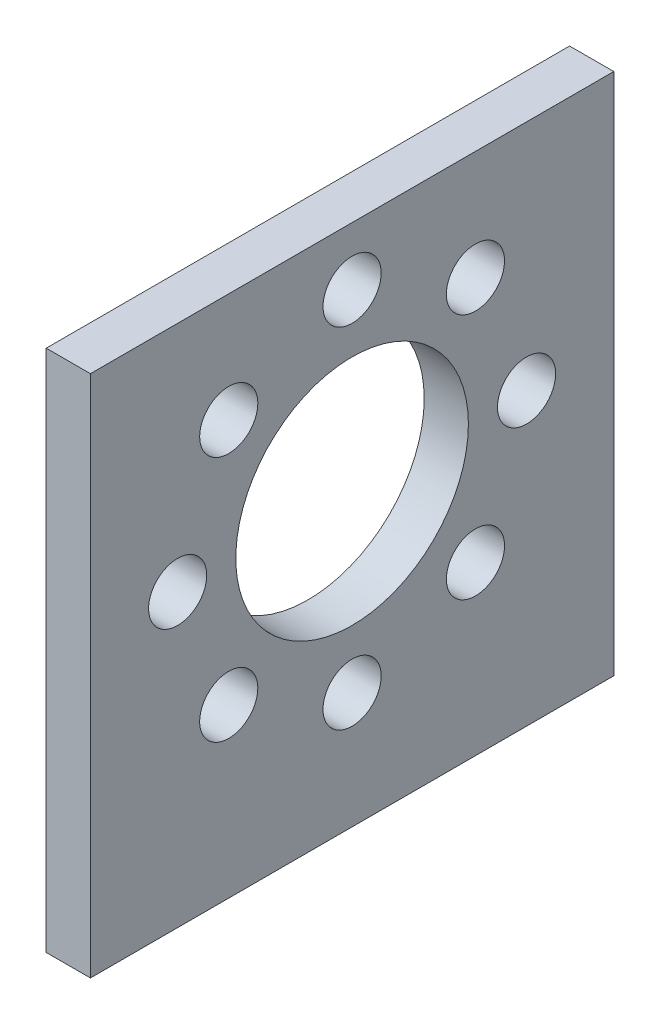
ISO-10303-21;
HEADER;
FILE_DESCRIPTION(('STEP AP214'),'2;1');
FILE_NAME('part.step','',(''),(''),'','','');
FILE_SCHEMA(('AUTOMOTIVE_DESIGN { 1 0 10303 214 1 1 1 1 }'));
ENDSEC;
DATA;
#1=APPLICATION_CONTEXT('core data for automotive mechanical design processes');
#2=APPLICATION_PROTOCOL_DEFINITION('international standard','automotive_design',2000,#1);
#3=PRODUCT_CONTEXT('',#1,'mechanical');
#4=PRODUCT('Part','Part','',(#3));
#5=PRODUCT_RELATED_PRODUCT_CATEGORY('part','',(#4));
#6=PRODUCT_DEFINITION_FORMATION('','',#4);
#7=PRODUCT_DEFINITION_CONTEXT('part definition',#1,'design');
#8=PRODUCT_DEFINITION('design','',#6,#7);
#9=PRODUCT_DEFINITION_SHAPE('','',#8);
#10=(LENGTH_UNIT() NAMED_UNIT(*) SI_UNIT(.MILLI.,.METRE.));
#11=(NAMED_UNIT(*) PLANE_ANGLE_UNIT() SI_UNIT($,.RADIAN.));
#12=(NAMED_UNIT(*) SI_UNIT($,.STERADIAN.) SOLID_ANGLE_UNIT());
#13=UNCERTAINTY_MEASURE_WITH_UNIT(LENGTH_MEASURE(1.E-05),#10,'distance_accuracy_value','');
#14=(GEOMETRIC_REPRESENTATION_CONTEXT(3) GLOBAL_UNCERTAINTY_ASSIGNED_CONTEXT((#13)) GLOBAL_UNIT_ASSIGNED_CONTEXT((#10,
#11,#12)) REPRESENTATION_CONTEXT('',''));
#15=CARTESIAN_POINT('',(0.,0.,0.));
#16=DIRECTION('',(0.,0.,1.));
#17=DIRECTION('',(1.,0.,0.));
#18=AXIS2_PLACEMENT_3D('',#15,#16,#17);
#19=CARTESIAN_POINT('',(4.826,0.,-9.13813740933418));
#20=DIRECTION('',(0.,0.,1.));
#21=DIRECTION('',(0.,-1.,0.));
#22=AXIS2_PLACEMENT_3D('',#19,#20,#21);
#23=PLANE('',#22);
#24=DIRECTION('',(0.,1.,0.));
#25=VECTOR('',#24,1.);
#26=CARTESIAN_POINT('',(0.,0.,-9.13813740933418));
#27=LINE('',#26,#25);
#28=CARTESIAN_POINT('',(0.,-21.6650709307293,-9.13813740933419));
#29=VERTEX_POINT('',#28);
#30=CARTESIAN_POINT('',(0.,35.4849290692707,-9.13813740933418));
#31=VERTEX_POINT('',#30);
#32=EDGE_CURVE('E108',#29,#31,#27,.T.);
#33=ORIENTED_EDGE('',*,*,#32,.T.);
#34=DIRECTION('',(-1.,0.,0.));
#35=VECTOR('',#34,1.);
#36=CARTESIAN_POINT('',(4.826,35.4849290692707,-9.13813740933418));
#37=LINE('',#36,#35);
#38=CARTESIAN_POINT('',(4.826,35.4849290692707,-9.13813740933418));
#39=VERTEX_POINT('',#38);
#40=EDGE_CURVE('E11',#39,#31,#37,.T.);
#41=ORIENTED_EDGE('',*,*,#40,.F.);
#42=DIRECTION('',(0.,1.,0.));
#43=VECTOR('',#42,1.);
#44=CARTESIAN_POINT('',(4.826,0.,-9.13813740933418));
#45=LINE('',#44,#43);
#46=CARTESIAN_POINT('',(4.826,-21.6650709307293,-9.13813740933419));
#47=VERTEX_POINT('',#46);
#48=EDGE_CURVE('E93',#47,#39,#45,.T.);
#49=ORIENTED_EDGE('',*,*,#48,.F.);
#50=DIRECTION('',(-1.,0.,0.));
#51=VECTOR('',#50,1.);
#52=CARTESIAN_POINT('',(4.826,-21.6650709307293,-9.13813740933419));
#53=LINE('',#52,#51);
#54=EDGE_CURVE('E107',#47,#29,#53,.T.);
#55=ORIENTED_EDGE('',*,*,#54,.T.);
#56=EDGE_LOOP('',(#33,#41,#49,#55));
#57=FACE_BOUND('',#56,.T.);
#58=ADVANCED_FACE('F41',(#57),#23,.F.);
#59=CARTESIAN_POINT('',(4.826,35.4849290692707,0.));
#60=DIRECTION('',(0.,-1.,0.));
#61=DIRECTION('',(0.,0.,-1.));
#62=AXIS2_PLACEMENT_3D('',#59,#60,#61);
#63=PLANE('',#62);
#64=DIRECTION('',(0.,0.,1.));
#65=VECTOR('',#64,1.);
#66=CARTESIAN_POINT('',(0.,35.4849290692707,0.));
#67=LINE('',#66,#65);
#68=CARTESIAN_POINT('',(0.,35.4849290692707,48.0118625906658));
#69=VERTEX_POINT('',#68);
#70=EDGE_CURVE('E97',#31,#69,#67,.T.);
#71=ORIENTED_EDGE('',*,*,#70,.T.);
#72=DIRECTION('',(-1.,0.,0.));
#73=VECTOR('',#72,1.);
#74=CARTESIAN_POINT('',(4.826,35.4849290692707,48.0118625906658));
#75=LINE('',#74,#73);
#76=CARTESIAN_POINT('',(4.826,35.4849290692707,48.0118625906658));
#77=VERTEX_POINT('',#76);
#78=EDGE_CURVE('E49',#77,#69,#75,.T.);
#79=ORIENTED_EDGE('',*,*,#78,.F.);
#80=DIRECTION('',(0.,0.,1.));
#81=VECTOR('',#80,1.);
#82=CARTESIAN_POINT('',(4.826,35.4849290692707,0.));
#83=LINE('',#82,#81);
#84=EDGE_CURVE('E87',#39,#77,#83,.T.);
#85=ORIENTED_EDGE('',*,*,#84,.F.);
#86=ORIENTED_EDGE('',*,*,#40,.T.);
#87=EDGE_LOOP('',(#71,#79,#85,#86));
#88=FACE_BOUND('',#87,.T.);
#89=ADVANCED_FACE('F96',(#88),#63,.F.);
#90=CARTESIAN_POINT('',(4.826,0.,48.0118625906658));
#91=DIRECTION('',(0.,0.,-1.));
#92=DIRECTION('',(-1.,0.,0.));
#93=AXIS2_PLACEMENT_3D('',#90,#91,#92);
#94=PLANE('',#93);
#95=DIRECTION('',(0.,-1.,0.));
#96=VECTOR('',#95,1.);
#97=CARTESIAN_POINT('',(0.,0.,48.0118625906658));
#98=LINE('',#97,#96);
#99=CARTESIAN_POINT('',(0.,-21.6650709307293,48.0118625906658));
#100=VERTEX_POINT('',#99);
#101=EDGE_CURVE('E74',#69,#100,#98,.T.);
#102=ORIENTED_EDGE('',*,*,#101,.T.);
#103=DIRECTION('',(-1.,0.,0.));
#104=VECTOR('',#103,1.);
#105=CARTESIAN_POINT('',(4.826,-21.6650709307293,48.0118625906658));
#106=LINE('',#105,#104);
#107=CARTESIAN_POINT('',(4.826,-21.6650709307293,48.0118625906658));
#108=VERTEX_POINT('',#107);
#109=EDGE_CURVE('E98',#108,#100,#106,.T.);
#110=ORIENTED_EDGE('',*,*,#109,.F.);
#111=DIRECTION('',(0.,-1.,0.));
#112=VECTOR('',#111,1.);
#113=CARTESIAN_POINT('',(4.826,0.,48.0118625906658));
#114=LINE('',#113,#112);
#115=EDGE_CURVE('E91',#77,#108,#114,.T.);
#116=ORIENTED_EDGE('',*,*,#115,.F.);
#117=ORIENTED_EDGE('',*,*,#78,.T.);
#118=EDGE_LOOP('',(#102,#110,#116,#117));
#119=FACE_BOUND('',#118,.T.);
#120=ADVANCED_FACE('F99',(#119),#94,.F.);
#121=CARTESIAN_POINT('',(4.826,-21.6650709307293,0.));
#122=DIRECTION('',(0.,1.,0.));
#123=DIRECTION('',(0.,0.,1.));
#124=AXIS2_PLACEMENT_3D('',#121,#122,#123);
#125=PLANE('',#124);
#126=DIRECTION('',(0.,0.,-1.));
#127=VECTOR('',#126,1.);
#128=CARTESIAN_POINT('',(0.,-21.6650709307293,0.));
#129=LINE('',#128,#127);
#130=EDGE_CURVE('E80',#100,#29,#129,.T.);
#131=ORIENTED_EDGE('',*,*,#130,.T.);
#132=ORIENTED_EDGE('',*,*,#54,.F.);
#133=DIRECTION('',(0.,0.,-1.));
#134=VECTOR('',#133,1.);
#135=CARTESIAN_POINT('',(4.826,-21.6650709307293,0.));
#136=LINE('',#135,#134);
#137=EDGE_CURVE('E57',#108,#47,#136,.T.);
#138=ORIENTED_EDGE('',*,*,#137,.F.);
#139=ORIENTED_EDGE('',*,*,#109,.T.);
#140=EDGE_LOOP('',(#131,#132,#138,#139));
#141=FACE_BOUND('',#140,.T.);
#142=ADVANCED_FACE('F119',(#141),#125,.F.);
#143=CARTESIAN_POINT('',(4.826,10.0849290692707,19.4368625906658));
#144=DIRECTION('',(-1.,0.,0.));
#145=DIRECTION('',(0.,0.,1.));
#146=AXIS2_PLACEMENT_3D('',#143,#144,#145);
#147=CYLINDRICAL_SURFACE('',#146,12.7);
#148=CARTESIAN_POINT('',(4.826,10.0849290692707,19.4368625906658));
#149=DIRECTION('',(1.,0.,0.));
#150=DIRECTION('',(0.,0.,-1.));
#151=AXIS2_PLACEMENT_3D('',#148,#149,#150);
#152=CIRCLE('',#151,12.7);
#153=CARTESIAN_POINT('',(4.826,10.0849290692707,6.73686259066581));
#154=VERTEX_POINT('',#153);
#155=EDGE_CURVE('E101',#154,#154,#152,.T.);
#156=ORIENTED_EDGE('',*,*,#155,.T.);
#157=EDGE_LOOP('',(#156));
#158=FACE_BOUND('',#157,.T.);
#159=CARTESIAN_POINT('',(0.,10.0849290692707,19.4368625906658));
#160=DIRECTION('',(1.,0.,0.));
#161=DIRECTION('',(0.,0.,-1.));
#162=AXIS2_PLACEMENT_3D('',#159,#160,#161);
#163=CIRCLE('',#162,12.7);
#164=CARTESIAN_POINT('',(0.,10.0849290692707,6.73686259066581));
#165=VERTEX_POINT('',#164);
#166=EDGE_CURVE('E115',#165,#165,#163,.T.);
#167=ORIENTED_EDGE('',*,*,#166,.F.);
#168=EDGE_LOOP('',(#167));
#169=FACE_BOUND('',#168,.T.);
#170=ADVANCED_FACE('F179',(#158,#169),#147,.F.);
#171=CARTESIAN_POINT('',(4.826,0.,0.));
#172=DIRECTION('',(1.,0.,0.));
#173=DIRECTION('',(0.,0.,-1.));
#174=AXIS2_PLACEMENT_3D('',#171,#172,#173);
#175=PLANE('',#174);
#176=CARTESIAN_POINT('',(4.826,10.0849290692706,0.386862590665813));
#177=DIRECTION('',(1.,0.,0.));
#178=DIRECTION('',(0.,-1.,0.));
#179=AXIS2_PLACEMENT_3D('',#176,#177,#178);
#180=CIRCLE('',#179,3.175);
#181=CARTESIAN_POINT('',(4.826,6.90992906927063,0.386862590665824));
#182=VERTEX_POINT('',#181);
#183=EDGE_CURVE('E155',#182,#182,#180,.T.);
#184=ORIENTED_EDGE('',*,*,#183,.F.);
#185=EDGE_LOOP('',(#184));
#186=FACE_BOUND('',#185,.T.);
#187=CARTESIAN_POINT('',(4.826,-3.38545511233311,5.96647840906216));
#188=DIRECTION('',(1.,0.,0.));
#189=DIRECTION('',(0.,-0.707106781186544,0.707106781186551));
#190=AXIS2_PLACEMENT_3D('',#187,#188,#189);
#191=CIRCLE('',#190,3.175);
#192=CARTESIAN_POINT('',(4.826,-5.63051914260039,8.21154243932946));
#193=VERTEX_POINT('',#192);
#194=EDGE_CURVE('E149',#193,#193,#191,.T.);
#195=ORIENTED_EDGE('',*,*,#194,.F.);
#196=EDGE_LOOP('',(#195));
#197=FACE_BOUND('',#196,.T.);
#198=CARTESIAN_POINT('',(4.826,-8.96507093072931,19.4368625906658));
#199=DIRECTION('',(1.,0.,0.));
#200=DIRECTION('',(0.,0.,1.));
#201=AXIS2_PLACEMENT_3D('',#198,#199,#200);
#202=CIRCLE('',#201,3.175);
#203=CARTESIAN_POINT('',(4.826,-8.96507093072931,22.6118625906658));
#204=VERTEX_POINT('',#203);
#205=EDGE_CURVE('E141',#204,#204,#202,.T.);
#206=ORIENTED_EDGE('',*,*,#205,.F.);
#207=EDGE_LOOP('',(#206));
#208=FACE_BOUND('',#207,.T.);
#209=CARTESIAN_POINT('',(4.826,-3.38545511233292,32.9072467722697));
#210=DIRECTION('',(1.,0.,0.));
#211=DIRECTION('',(0.,0.707106781186554,0.707106781186541));
#212=AXIS2_PLACEMENT_3D('',#209,#210,#211);
#213=CIRCLE('',#212,3.175);
#214=CARTESIAN_POINT('',(4.826,-1.14039108206561,35.1523108025369));
#215=VERTEX_POINT('',#214);
#216=EDGE_CURVE('E142',#215,#215,#213,.T.);
#217=ORIENTED_EDGE('',*,*,#216,.F.);
#218=EDGE_LOOP('',(#217));
#219=FACE_BOUND('',#218,.T.);
#220=CARTESIAN_POINT('',(4.826,10.0849290692709,38.4868625906658));
#221=DIRECTION('',(1.,0.,0.));
#222=DIRECTION('',(0.,1.,0.));
#223=AXIS2_PLACEMENT_3D('',#220,#221,#222);
#224=CIRCLE('',#223,3.175);
#225=CARTESIAN_POINT('',(4.826,13.2599290692709,38.4868625906658));
#226=VERTEX_POINT('',#225);
#227=EDGE_CURVE('E165',#226,#226,#224,.T.);
#228=ORIENTED_EDGE('',*,*,#227,.F.);
#229=EDGE_LOOP('',(#228));
#230=FACE_BOUND('',#229,.T.);
#231=CARTESIAN_POINT('',(4.826,23.5553132508746,32.9072467722694));
#232=DIRECTION('',(1.,0.,0.));
#233=DIRECTION('',(0.,0.707106781186539,-0.707106781186556));
#234=AXIS2_PLACEMENT_3D('',#231,#232,#233);
#235=CIRCLE('',#234,3.175);
#236=CARTESIAN_POINT('',(4.826,25.8003772811419,30.6621827420021));
#237=VERTEX_POINT('',#236);
#238=EDGE_CURVE('E166',#237,#237,#235,.T.);
#239=ORIENTED_EDGE('',*,*,#238,.F.);
#240=EDGE_LOOP('',(#239));
#241=FACE_BOUND('',#240,.T.);
#242=CARTESIAN_POINT('',(4.826,23.5553132508744,5.96647840906206));
#243=DIRECTION('',(1.,0.,0.));
#244=DIRECTION('',(0.,-0.707106781186549,-0.707106781186546));
#245=AXIS2_PLACEMENT_3D('',#242,#243,#244);
#246=CIRCLE('',#245,3.175);
#247=CARTESIAN_POINT('',(4.826,21.3102492206071,3.72141437879477));
#248=VERTEX_POINT('',#247);
#249=EDGE_CURVE('E134',#248,#248,#246,.T.);
#250=ORIENTED_EDGE('',*,*,#249,.F.);
#251=EDGE_LOOP('',(#250));
#252=FACE_BOUND('',#251,.T.);
#253=CARTESIAN_POINT('',(4.826,29.1349290692707,19.4368625906658));
#254=DIRECTION('',(1.,0.,0.));
#255=DIRECTION('',(0.,0.,-1.));
#256=AXIS2_PLACEMENT_3D('',#253,#254,#255);
#257=CIRCLE('',#256,3.175);
#258=CARTESIAN_POINT('',(4.826,29.1349290692707,16.2618625906658));
#259=VERTEX_POINT('',#258);
#260=EDGE_CURVE('E111',#259,#259,#257,.T.);
#261=ORIENTED_EDGE('',*,*,#260,.F.);
#262=EDGE_LOOP('',(#261));
#263=FACE_BOUND('',#262,.T.);
#264=ORIENTED_EDGE('',*,*,#48,.T.);
#265=ORIENTED_EDGE('',*,*,#84,.T.);
#266=ORIENTED_EDGE('',*,*,#115,.T.);
#267=ORIENTED_EDGE('',*,*,#137,.T.);
#268=EDGE_LOOP('',(#264,#265,#266,#267));
#269=FACE_BOUND('',#268,.T.);
#270=ORIENTED_EDGE('',*,*,#155,.F.);
#271=EDGE_LOOP('',(#270));
#272=FACE_BOUND('',#271,.T.);
#273=ADVANCED_FACE('F88',(#186,#197,#208,#219,#230,#241,#252,#263,#269,#272),#175,.T.);
#274=CARTESIAN_POINT('',(0.,0.,0.));
#275=DIRECTION('',(1.,0.,0.));
#276=DIRECTION('',(0.,0.,-1.));
#277=AXIS2_PLACEMENT_3D('',#274,#275,#276);
#278=PLANE('',#277);
#279=CARTESIAN_POINT('',(0.,10.0849290692706,0.386862590665813));
#280=DIRECTION('',(1.,0.,0.));
#281=DIRECTION('',(0.,-1.,0.));
#282=AXIS2_PLACEMENT_3D('',#279,#280,#281);
#283=CIRCLE('',#282,3.175);
#284=CARTESIAN_POINT('',(0.,6.90992906927063,0.386862590665824));
#285=VERTEX_POINT('',#284);
#286=EDGE_CURVE('E137',#285,#285,#283,.T.);
#287=ORIENTED_EDGE('',*,*,#286,.T.);
#288=EDGE_LOOP('',(#287));
#289=FACE_BOUND('',#288,.T.);
#290=CARTESIAN_POINT('',(0.,-3.38545511233311,5.96647840906216));
#291=DIRECTION('',(1.,0.,0.));
#292=DIRECTION('',(0.,-0.707106781186544,0.707106781186551));
#293=AXIS2_PLACEMENT_3D('',#290,#291,#292);
#294=CIRCLE('',#293,3.175);
#295=CARTESIAN_POINT('',(0.,-5.63051914260039,8.21154243932946));
#296=VERTEX_POINT('',#295);
#297=EDGE_CURVE('E152',#296,#296,#294,.T.);
#298=ORIENTED_EDGE('',*,*,#297,.T.);
#299=EDGE_LOOP('',(#298));
#300=FACE_BOUND('',#299,.T.);
#301=CARTESIAN_POINT('',(0.,-8.96507093072931,19.4368625906658));
#302=DIRECTION('',(1.,0.,0.));
#303=DIRECTION('',(0.,0.,1.));
#304=AXIS2_PLACEMENT_3D('',#301,#302,#303);
#305=CIRCLE('',#304,3.175);
#306=CARTESIAN_POINT('',(0.,-8.96507093072931,22.6118625906658));
#307=VERTEX_POINT('',#306);
#308=EDGE_CURVE('E146',#307,#307,#305,.T.);
#309=ORIENTED_EDGE('',*,*,#308,.T.);
#310=EDGE_LOOP('',(#309));
#311=FACE_BOUND('',#310,.T.);
#312=CARTESIAN_POINT('',(0.,-3.38545511233292,32.9072467722697));
#313=DIRECTION('',(1.,0.,0.));
#314=DIRECTION('',(0.,0.707106781186554,0.707106781186541));
#315=AXIS2_PLACEMENT_3D('',#312,#313,#314);
#316=CIRCLE('',#315,3.175);
#317=CARTESIAN_POINT('',(0.,-1.14039108206561,35.1523108025369));
#318=VERTEX_POINT('',#317);
#319=EDGE_CURVE('E138',#318,#318,#316,.T.);
#320=ORIENTED_EDGE('',*,*,#319,.T.);
#321=EDGE_LOOP('',(#320));
#322=FACE_BOUND('',#321,.T.);
#323=CARTESIAN_POINT('',(0.,10.0849290692709,38.4868625906658));
#324=DIRECTION('',(1.,0.,0.));
#325=DIRECTION('',(0.,1.,0.));
#326=AXIS2_PLACEMENT_3D('',#323,#324,#325);
#327=CIRCLE('',#326,3.175);
#328=CARTESIAN_POINT('',(0.,13.2599290692709,38.4868625906658));
#329=VERTEX_POINT('',#328);
#330=EDGE_CURVE('E145',#329,#329,#327,.T.);
#331=ORIENTED_EDGE('',*,*,#330,.T.);
#332=EDGE_LOOP('',(#331));
#333=FACE_BOUND('',#332,.T.);
#334=CARTESIAN_POINT('',(0.,23.5553132508746,32.9072467722694));
#335=DIRECTION('',(1.,0.,0.));
#336=DIRECTION('',(0.,0.707106781186539,-0.707106781186556));
#337=AXIS2_PLACEMENT_3D('',#334,#335,#336);
#338=CIRCLE('',#337,3.175);
#339=CARTESIAN_POINT('',(0.,25.8003772811419,30.6621827420021));
#340=VERTEX_POINT('',#339);
#341=EDGE_CURVE('E162',#340,#340,#338,.T.);
#342=ORIENTED_EDGE('',*,*,#341,.T.);
#343=EDGE_LOOP('',(#342));
#344=FACE_BOUND('',#343,.T.);
#345=CARTESIAN_POINT('',(0.,23.5553132508744,5.96647840906206));
#346=DIRECTION('',(1.,0.,0.));
#347=DIRECTION('',(0.,-0.707106781186549,-0.707106781186546));
#348=AXIS2_PLACEMENT_3D('',#345,#346,#347);
#349=CIRCLE('',#348,3.175);
#350=CARTESIAN_POINT('',(0.,21.3102492206071,3.72141437879477));
#351=VERTEX_POINT('',#350);
#352=EDGE_CURVE('E129',#351,#351,#349,.T.);
#353=ORIENTED_EDGE('',*,*,#352,.T.);
#354=EDGE_LOOP('',(#353));
#355=FACE_BOUND('',#354,.T.);
#356=CARTESIAN_POINT('',(0.,29.1349290692707,19.4368625906658));
#357=DIRECTION('',(1.,0.,0.));
#358=DIRECTION('',(0.,0.,-1.));
#359=AXIS2_PLACEMENT_3D('',#356,#357,#358);
#360=CIRCLE('',#359,3.175);
#361=CARTESIAN_POINT('',(0.,29.1349290692707,16.2618625906658));
#362=VERTEX_POINT('',#361);
#363=EDGE_CURVE('E126',#362,#362,#360,.T.);
#364=ORIENTED_EDGE('',*,*,#363,.T.);
#365=EDGE_LOOP('',(#364));
#366=FACE_BOUND('',#365,.T.);
#367=ORIENTED_EDGE('',*,*,#32,.F.);
#368=ORIENTED_EDGE('',*,*,#130,.F.);
#369=ORIENTED_EDGE('',*,*,#101,.F.);
#370=ORIENTED_EDGE('',*,*,#70,.F.);
#371=EDGE_LOOP('',(#367,#368,#369,#370));
#372=FACE_BOUND('',#371,.T.);
#373=ORIENTED_EDGE('',*,*,#166,.T.);
#374=EDGE_LOOP('',(#373));
#375=FACE_BOUND('',#374,.T.);
#376=ADVANCED_FACE('F122',(#289,#300,#311,#322,#333,#344,#355,#366,#372,#375),#278,.F.);
#377=CARTESIAN_POINT('',(4.826,29.1349290692707,19.4368625906658));
#378=DIRECTION('',(-1.,0.,0.));
#379=DIRECTION('',(0.,0.,1.));
#380=AXIS2_PLACEMENT_3D('',#377,#378,#379);
#381=CYLINDRICAL_SURFACE('',#380,3.175);
#382=ORIENTED_EDGE('',*,*,#260,.T.);
#383=EDGE_LOOP('',(#382));
#384=FACE_BOUND('',#383,.T.);
#385=ORIENTED_EDGE('',*,*,#363,.F.);
#386=EDGE_LOOP('',(#385));
#387=FACE_BOUND('',#386,.T.);
#388=ADVANCED_FACE('F188',(#384,#387),#381,.F.);
#389=CARTESIAN_POINT('',(4.826,23.5553132508744,5.96647840906206));
#390=DIRECTION('',(-1.,0.,0.));
#391=DIRECTION('',(0.,0.707106781186549,0.707106781186546));
#392=AXIS2_PLACEMENT_3D('',#389,#390,#391);
#393=CYLINDRICAL_SURFACE('',#392,3.175);
#394=ORIENTED_EDGE('',*,*,#249,.T.);
#395=EDGE_LOOP('',(#394));
#396=FACE_BOUND('',#395,.T.);
#397=ORIENTED_EDGE('',*,*,#352,.F.);
#398=EDGE_LOOP('',(#397));
#399=FACE_BOUND('',#398,.T.);
#400=ADVANCED_FACE('F191',(#396,#399),#393,.F.);
#401=CARTESIAN_POINT('',(4.826,23.5553132508746,32.9072467722694));
#402=DIRECTION('',(-1.,0.,0.));
#403=DIRECTION('',(0.,-0.707106781186539,0.707106781186556));
#404=AXIS2_PLACEMENT_3D('',#401,#402,#403);
#405=CYLINDRICAL_SURFACE('',#404,3.175);
#406=ORIENTED_EDGE('',*,*,#238,.T.);
#407=EDGE_LOOP('',(#406));
#408=FACE_BOUND('',#407,.T.);
#409=ORIENTED_EDGE('',*,*,#341,.F.);
#410=EDGE_LOOP('',(#409));
#411=FACE_BOUND('',#410,.T.);
#412=ADVANCED_FACE('F243',(#408,#411),#405,.F.);
#413=CARTESIAN_POINT('',(4.826,10.0849290692709,38.4868625906658));
#414=DIRECTION('',(-1.,0.,0.));
#415=DIRECTION('',(0.,-1.,0.));
#416=AXIS2_PLACEMENT_3D('',#413,#414,#415);
#417=CYLINDRICAL_SURFACE('',#416,3.175);
#418=ORIENTED_EDGE('',*,*,#227,.T.);
#419=EDGE_LOOP('',(#418));
#420=FACE_BOUND('',#419,.T.);
#421=ORIENTED_EDGE('',*,*,#330,.F.);
#422=EDGE_LOOP('',(#421));
#423=FACE_BOUND('',#422,.T.);
#424=ADVANCED_FACE('F174',(#420,#423),#417,.F.);
#425=CARTESIAN_POINT('',(4.826,-3.38545511233292,32.9072467722697));
#426=DIRECTION('',(-1.,0.,0.));
#427=DIRECTION('',(0.,-0.707106781186554,-0.707106781186541));
#428=AXIS2_PLACEMENT_3D('',#425,#426,#427);
#429=CYLINDRICAL_SURFACE('',#428,3.175);
#430=ORIENTED_EDGE('',*,*,#216,.T.);
#431=EDGE_LOOP('',(#430));
#432=FACE_BOUND('',#431,.T.);
#433=ORIENTED_EDGE('',*,*,#319,.F.);
#434=EDGE_LOOP('',(#433));
#435=FACE_BOUND('',#434,.T.);
#436=ADVANCED_FACE('F262',(#432,#435),#429,.F.);
#437=CARTESIAN_POINT('',(4.826,-8.96507093072931,19.4368625906658));
#438=DIRECTION('',(-1.,0.,0.));
#439=DIRECTION('',(0.,0.,-1.));
#440=AXIS2_PLACEMENT_3D('',#437,#438,#439);
#441=CYLINDRICAL_SURFACE('',#440,3.175);
#442=ORIENTED_EDGE('',*,*,#205,.T.);
#443=EDGE_LOOP('',(#442));
#444=FACE_BOUND('',#443,.T.);
#445=ORIENTED_EDGE('',*,*,#308,.F.);
#446=EDGE_LOOP('',(#445));
#447=FACE_BOUND('',#446,.T.);
#448=ADVANCED_FACE('F271',(#444,#447),#441,.F.);
#449=CARTESIAN_POINT('',(4.826,-3.38545511233311,5.96647840906216));
#450=DIRECTION('',(-1.,0.,0.));
#451=DIRECTION('',(0.,0.707106781186544,-0.707106781186551));
#452=AXIS2_PLACEMENT_3D('',#449,#450,#451);
#453=CYLINDRICAL_SURFACE('',#452,3.175);
#454=ORIENTED_EDGE('',*,*,#194,.T.);
#455=EDGE_LOOP('',(#454));
#456=FACE_BOUND('',#455,.T.);
#457=ORIENTED_EDGE('',*,*,#297,.F.);
#458=EDGE_LOOP('',(#457));
#459=FACE_BOUND('',#458,.T.);
#460=ADVANCED_FACE('F281',(#456,#459),#453,.F.);
#461=CARTESIAN_POINT('',(4.826,10.0849290692706,0.386862590665813));
#462=DIRECTION('',(-1.,0.,0.));
#463=DIRECTION('',(0.,1.,0.));
#464=AXIS2_PLACEMENT_3D('',#461,#462,#463);
#465=CYLINDRICAL_SURFACE('',#464,3.175);
#466=ORIENTED_EDGE('',*,*,#183,.T.);
#467=EDGE_LOOP('',(#466));
#468=FACE_BOUND('',#467,.T.);
#469=ORIENTED_EDGE('',*,*,#286,.F.);
#470=EDGE_LOOP('',(#469));
#471=FACE_BOUND('',#470,.T.);
#472=ADVANCED_FACE('F291',(#468,#471),#465,.F.);
#473=CLOSED_SHELL('',(#58,#89,#120,#142,#170,#273,#376,#388,#400,#412,#424,#436,#448,#460,#472));
#474=MANIFOLD_SOLID_BREP('B2',#473);
#475=ADVANCED_BREP_SHAPE_REPRESENTATION('',(#18,#474),#14);
#476=SHAPE_DEFINITION_REPRESENTATION(#9,#475);
ENDSEC;
END-ISO-10303-21;
